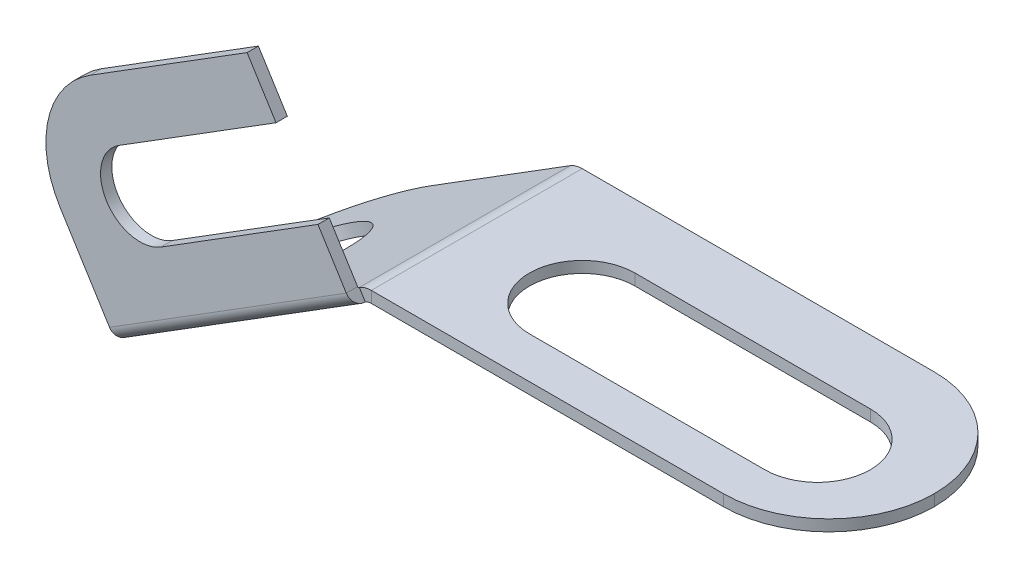
ISO-10303-21;
HEADER;
FILE_DESCRIPTION(('STEP AP214'),'2;1');
FILE_NAME('part.step','',(''),(''),'','','');
FILE_SCHEMA(('AUTOMOTIVE_DESIGN { 1 0 10303 214 1 1 1 1 }'));
ENDSEC;
DATA;
#1=APPLICATION_CONTEXT('core data for automotive mechanical design processes');
#2=APPLICATION_PROTOCOL_DEFINITION('international standard','automotive_design',2000,#1);
#3=PRODUCT_CONTEXT('',#1,'mechanical');
#4=PRODUCT('Part','Part','',(#3));
#5=PRODUCT_RELATED_PRODUCT_CATEGORY('part','',(#4));
#6=PRODUCT_DEFINITION_FORMATION('','',#4);
#7=PRODUCT_DEFINITION_CONTEXT('part definition',#1,'design');
#8=PRODUCT_DEFINITION('design','',#6,#7);
#9=PRODUCT_DEFINITION_SHAPE('','',#8);
#10=(LENGTH_UNIT() NAMED_UNIT(*) SI_UNIT(.MILLI.,.METRE.));
#11=(NAMED_UNIT(*) PLANE_ANGLE_UNIT() SI_UNIT($,.RADIAN.));
#12=(NAMED_UNIT(*) SI_UNIT($,.STERADIAN.) SOLID_ANGLE_UNIT());
#13=UNCERTAINTY_MEASURE_WITH_UNIT(LENGTH_MEASURE(1.E-05),#10,'distance_accuracy_value','');
#14=(GEOMETRIC_REPRESENTATION_CONTEXT(3) GLOBAL_UNCERTAINTY_ASSIGNED_CONTEXT((#13)) GLOBAL_UNIT_ASSIGNED_CONTEXT((#10,
#11,#12)) REPRESENTATION_CONTEXT('',''));
#15=CARTESIAN_POINT('',(0.,0.,0.));
#16=DIRECTION('',(0.,0.,1.));
#17=DIRECTION('',(1.,0.,0.));
#18=AXIS2_PLACEMENT_3D('',#15,#16,#17);
#19=CARTESIAN_POINT('',(-1.80850957594118,0.829813867695201,0.626000000000004));
#20=DIRECTION('',(-0.84804809615643,-0.529919264233199,0.));
#21=DIRECTION('',(0.529919264233199,-0.84804809615643,0.));
#22=AXIS2_PLACEMENT_3D('',#19,#20,#21);
#23=PLANE('',#22);
#24=DIRECTION('',(0.529919264233199,-0.84804809615643,0.));
#25=VECTOR('',#24,1.);
#26=CARTESIAN_POINT('',(-1.80850957594118,0.829813867695201,0.566000000000004));
#27=LINE('',#26,#25);
#28=CARTESIAN_POINT('',(-1.28176982729339,-0.013145939884287,0.566));
#29=VERTEX_POINT('',#28);
#30=CARTESIAN_POINT('',(-1.43226689833561,0.227699719424136,0.566000000000001));
#31=VERTEX_POINT('',#30);
#32=EDGE_CURVE('E323',#29,#31,#27,.F.);
#33=ORIENTED_EDGE('',*,*,#32,.T.);
#34=DIRECTION('',(0.,0.,1.));
#35=VECTOR('',#34,1.);
#36=CARTESIAN_POINT('',(-1.43226689833561,0.227699719424136,0.626000000000001));
#37=LINE('',#36,#35);
#38=CARTESIAN_POINT('',(-1.43226689833561,0.227699719424136,0.626000000000001));
#39=VERTEX_POINT('',#38);
#40=EDGE_CURVE('E298',#31,#39,#37,.T.);
#41=ORIENTED_EDGE('',*,*,#40,.T.);
#42=DIRECTION('',(-0.529919264233199,0.84804809615643,0.));
#43=VECTOR('',#42,1.);
#44=CARTESIAN_POINT('',(-0.92773811445232,-0.579715114319397,0.625999999999998));
#45=LINE('',#44,#43);
#46=CARTESIAN_POINT('',(-1.28176982729338,-0.0131459398842896,0.626));
#47=VERTEX_POINT('',#46);
#48=EDGE_CURVE('E314',#47,#39,#45,.T.);
#49=ORIENTED_EDGE('',*,*,#48,.F.);
#50=DIRECTION('',(0.,0.,-1.));
#51=VECTOR('',#50,1.);
#52=CARTESIAN_POINT('',(-1.28176982729338,-0.0131459398842896,0.566));
#53=LINE('',#52,#51);
#54=EDGE_CURVE('E330',#29,#47,#53,.F.);
#55=ORIENTED_EDGE('',*,*,#54,.F.);
#56=EDGE_LOOP('',(#33,#41,#49,#55));
#57=FACE_BOUND('',#56,.T.);
#58=ADVANCED_FACE('F77',(#57),#23,.F.);
#59=CARTESIAN_POINT('',(-1.215,-0.06,0.56));
#60=DIRECTION('',(0.,0.,1.));
#61=DIRECTION('',(1.,0.,0.));
#62=AXIS2_PLACEMENT_3D('',#59,#60,#61);
#63=PLANE('',#62);
#64=DIRECTION('',(1.,0.,0.));
#65=VECTOR('',#64,1.);
#66=CARTESIAN_POINT('',(-1.215,-0.06,0.56));
#67=LINE('',#66,#65);
#68=CARTESIAN_POINT('',(-1.215,-0.06,0.56));
#69=VERTEX_POINT('',#68);
#70=CARTESIAN_POINT('',(0.655,-0.06,0.56));
#71=VERTEX_POINT('',#70);
#72=EDGE_CURVE('E395',#69,#71,#67,.T.);
#73=ORIENTED_EDGE('',*,*,#72,.T.);
#74=DIRECTION('',(0.,1.,0.));
#75=VECTOR('',#74,1.);
#76=CARTESIAN_POINT('',(0.655,-0.06,0.56));
#77=LINE('',#76,#75);
#78=CARTESIAN_POINT('',(0.655,0.,0.56));
#79=VERTEX_POINT('',#78);
#80=EDGE_CURVE('E431',#71,#79,#77,.T.);
#81=ORIENTED_EDGE('',*,*,#80,.T.);
#82=DIRECTION('',(1.,0.,0.));
#83=VECTOR('',#82,1.);
#84=CARTESIAN_POINT('',(-1.215,0.,0.56));
#85=LINE('',#84,#83);
#86=CARTESIAN_POINT('',(-1.215,0.,0.56));
#87=VERTEX_POINT('',#86);
#88=EDGE_CURVE('E393',#87,#79,#85,.T.);
#89=ORIENTED_EDGE('',*,*,#88,.F.);
#90=DIRECTION('',(0.,1.,0.));
#91=VECTOR('',#90,1.);
#92=CARTESIAN_POINT('',(-1.215,-0.06,0.56));
#93=LINE('',#92,#91);
#94=EDGE_CURVE('E405',#69,#87,#93,.T.);
#95=ORIENTED_EDGE('',*,*,#94,.F.);
#96=EDGE_LOOP('',(#73,#81,#89,#95));
#97=FACE_BOUND('',#96,.T.);
#98=ADVANCED_FACE('F450',(#97),#63,.T.);
#99=CARTESIAN_POINT('',(-1.215,-0.06,-0.56));
#100=DIRECTION('',(0.,0.,-1.));
#101=DIRECTION('',(-1.,0.,0.));
#102=AXIS2_PLACEMENT_3D('',#99,#100,#101);
#103=PLANE('',#102);
#104=DIRECTION('',(-1.,0.,0.));
#105=VECTOR('',#104,1.);
#106=CARTESIAN_POINT('',(-1.215,0.,-0.56));
#107=LINE('',#106,#105);
#108=CARTESIAN_POINT('',(0.655,0.,-0.56));
#109=VERTEX_POINT('',#108);
#110=CARTESIAN_POINT('',(-1.215,0.,-0.56));
#111=VERTEX_POINT('',#110);
#112=EDGE_CURVE('E381',#109,#111,#107,.T.);
#113=ORIENTED_EDGE('',*,*,#112,.F.);
#114=DIRECTION('',(0.,1.,0.));
#115=VECTOR('',#114,1.);
#116=CARTESIAN_POINT('',(0.655,-0.06,-0.56));
#117=LINE('',#116,#115);
#118=CARTESIAN_POINT('',(0.655,-0.06,-0.56));
#119=VERTEX_POINT('',#118);
#120=EDGE_CURVE('E13',#109,#119,#117,.F.);
#121=ORIENTED_EDGE('',*,*,#120,.T.);
#122=DIRECTION('',(-1.,0.,0.));
#123=VECTOR('',#122,1.);
#124=CARTESIAN_POINT('',(-1.215,-0.06,-0.56));
#125=LINE('',#124,#123);
#126=CARTESIAN_POINT('',(-1.215,-0.0600000000000008,-0.56));
#127=VERTEX_POINT('',#126);
#128=EDGE_CURVE('E390',#119,#127,#125,.T.);
#129=ORIENTED_EDGE('',*,*,#128,.T.);
#130=DIRECTION('',(0.,1.,0.));
#131=VECTOR('',#130,1.);
#132=CARTESIAN_POINT('',(-1.215,-0.06,-0.56));
#133=LINE('',#132,#131);
#134=EDGE_CURVE('E398',#127,#111,#133,.T.);
#135=ORIENTED_EDGE('',*,*,#134,.T.);
#136=EDGE_LOOP('',(#113,#121,#129,#135));
#137=FACE_BOUND('',#136,.T.);
#138=ADVANCED_FACE('F462',(#137),#103,.T.);
#139=CARTESIAN_POINT('',(0.,-0.06,0.));
#140=DIRECTION('',(0.,1.,0.));
#141=DIRECTION('',(0.,0.,1.));
#142=AXIS2_PLACEMENT_3D('',#139,#140,#141);
#143=PLANE('',#142);
#144=DIRECTION('',(-1.,0.,0.));
#145=VECTOR('',#144,1.);
#146=CARTESIAN_POINT('',(0.,-0.06,-0.22));
#147=LINE('',#146,#145);
#148=CARTESIAN_POINT('',(0.655,-0.0599999999999993,-0.22));
#149=VERTEX_POINT('',#148);
#150=CARTESIAN_POINT('',(-0.595,-0.0599999999999993,-0.22));
#151=VERTEX_POINT('',#150);
#152=EDGE_CURVE('E270',#149,#151,#147,.T.);
#153=ORIENTED_EDGE('',*,*,#152,.T.);
#154=CARTESIAN_POINT('',(-0.595,-0.0599999999999993,0.0600000000000002));
#155=DIRECTION('',(0.,1.,0.));
#156=DIRECTION('',(0.,0.,1.));
#157=AXIS2_PLACEMENT_3D('',#154,#155,#156);
#158=CIRCLE('',#157,0.28);
#159=CARTESIAN_POINT('',(-0.595,-0.0599999999999993,0.34));
#160=VERTEX_POINT('',#159);
#161=EDGE_CURVE('E273',#151,#160,#158,.T.);
#162=ORIENTED_EDGE('',*,*,#161,.T.);
#163=DIRECTION('',(1.,0.,0.));
#164=VECTOR('',#163,1.);
#165=CARTESIAN_POINT('',(0.,-0.06,0.34));
#166=LINE('',#165,#164);
#167=CARTESIAN_POINT('',(0.655,-0.06,0.34));
#168=VERTEX_POINT('',#167);
#169=EDGE_CURVE('E265',#160,#168,#166,.T.);
#170=ORIENTED_EDGE('',*,*,#169,.T.);
#171=CARTESIAN_POINT('',(0.655,-0.0599999999999993,0.0600000000000002));
#172=DIRECTION('',(0.,1.,0.));
#173=DIRECTION('',(0.,0.,1.));
#174=AXIS2_PLACEMENT_3D('',#171,#172,#173);
#175=CIRCLE('',#174,0.28);
#176=EDGE_CURVE('E240',#168,#149,#175,.T.);
#177=ORIENTED_EDGE('',*,*,#176,.T.);
#178=EDGE_LOOP('',(#153,#162,#170,#177));
#179=FACE_BOUND('',#178,.T.);
#180=CARTESIAN_POINT('',(0.655,-0.06,0.));
#181=DIRECTION('',(0.,1.,0.));
#182=DIRECTION('',(0.,0.,1.));
#183=AXIS2_PLACEMENT_3D('',#180,#181,#182);
#184=CIRCLE('',#183,0.56);
#185=CARTESIAN_POINT('',(1.215,-0.06,0.));
#186=VERTEX_POINT('',#185);
#187=EDGE_CURVE('E98',#119,#186,#184,.F.);
#188=ORIENTED_EDGE('',*,*,#187,.T.);
#189=CARTESIAN_POINT('',(0.655,-0.06,0.));
#190=DIRECTION('',(0.,1.,0.));
#191=DIRECTION('',(0.,0.,1.));
#192=AXIS2_PLACEMENT_3D('',#189,#190,#191);
#193=CIRCLE('',#192,0.56);
#194=EDGE_CURVE('E86',#186,#71,#193,.F.);
#195=ORIENTED_EDGE('',*,*,#194,.T.);
#196=ORIENTED_EDGE('',*,*,#72,.F.);
#197=DIRECTION('',(0.,0.,1.));
#198=VECTOR('',#197,1.);
#199=CARTESIAN_POINT('',(-1.215,-0.06,-0.56));
#200=LINE('',#199,#198);
#201=EDGE_CURVE('E392',#127,#69,#200,.T.);
#202=ORIENTED_EDGE('',*,*,#201,.F.);
#203=ORIENTED_EDGE('',*,*,#128,.F.);
#204=EDGE_LOOP('',(#188,#195,#196,#202,#203));
#205=FACE_BOUND('',#204,.T.);
#206=ADVANCED_FACE('F443',(#179,#205),#143,.F.);
#207=CARTESIAN_POINT('',(0.,0.,0.));
#208=DIRECTION('',(0.,1.,0.));
#209=DIRECTION('',(0.,0.,1.));
#210=AXIS2_PLACEMENT_3D('',#207,#208,#209);
#211=PLANE('',#210);
#212=CARTESIAN_POINT('',(-0.595,0.,0.0600000000000002));
#213=DIRECTION('',(0.,1.,0.));
#214=DIRECTION('',(0.,0.,1.));
#215=AXIS2_PLACEMENT_3D('',#212,#213,#214);
#216=CIRCLE('',#215,0.28);
#217=CARTESIAN_POINT('',(-0.595,0.,-0.22));
#218=VERTEX_POINT('',#217);
#219=CARTESIAN_POINT('',(-0.595,0.,0.34));
#220=VERTEX_POINT('',#219);
#221=EDGE_CURVE('E253',#218,#220,#216,.T.);
#222=ORIENTED_EDGE('',*,*,#221,.F.);
#223=DIRECTION('',(-1.,0.,0.));
#224=VECTOR('',#223,1.);
#225=CARTESIAN_POINT('',(-0.595,0.,-0.22));
#226=LINE('',#225,#224);
#227=CARTESIAN_POINT('',(0.655,0.,-0.22));
#228=VERTEX_POINT('',#227);
#229=EDGE_CURVE('E258',#228,#218,#226,.T.);
#230=ORIENTED_EDGE('',*,*,#229,.F.);
#231=CARTESIAN_POINT('',(0.655,0.,0.0600000000000002));
#232=DIRECTION('',(0.,1.,0.));
#233=DIRECTION('',(0.,0.,1.));
#234=AXIS2_PLACEMENT_3D('',#231,#232,#233);
#235=CIRCLE('',#234,0.28);
#236=CARTESIAN_POINT('',(0.655,0.,0.34));
#237=VERTEX_POINT('',#236);
#238=EDGE_CURVE('E237',#237,#228,#235,.T.);
#239=ORIENTED_EDGE('',*,*,#238,.F.);
#240=DIRECTION('',(1.,0.,0.));
#241=VECTOR('',#240,1.);
#242=CARTESIAN_POINT('',(-0.595,0.,0.34));
#243=LINE('',#242,#241);
#244=EDGE_CURVE('E248',#220,#237,#243,.T.);
#245=ORIENTED_EDGE('',*,*,#244,.F.);
#246=EDGE_LOOP('',(#222,#230,#239,#245));
#247=FACE_BOUND('',#246,.T.);
#248=ORIENTED_EDGE('',*,*,#88,.T.);
#249=CARTESIAN_POINT('',(0.655,0.,0.));
#250=DIRECTION('',(0.,1.,0.));
#251=DIRECTION('',(0.,0.,1.));
#252=AXIS2_PLACEMENT_3D('',#249,#250,#251);
#253=CIRCLE('',#252,0.56);
#254=CARTESIAN_POINT('',(1.215,0.,0.));
#255=VERTEX_POINT('',#254);
#256=EDGE_CURVE('E438',#79,#255,#253,.T.);
#257=ORIENTED_EDGE('',*,*,#256,.T.);
#258=CARTESIAN_POINT('',(0.655,0.,0.));
#259=DIRECTION('',(0.,1.,0.));
#260=DIRECTION('',(0.,0.,1.));
#261=AXIS2_PLACEMENT_3D('',#258,#259,#260);
#262=CIRCLE('',#261,0.56);
#263=EDGE_CURVE('E436',#255,#109,#262,.T.);
#264=ORIENTED_EDGE('',*,*,#263,.T.);
#265=ORIENTED_EDGE('',*,*,#112,.T.);
#266=DIRECTION('',(0.,0.,1.));
#267=VECTOR('',#266,1.);
#268=CARTESIAN_POINT('',(-1.215,0.,-0.56));
#269=LINE('',#268,#267);
#270=EDGE_CURVE('E400',#111,#87,#269,.T.);
#271=ORIENTED_EDGE('',*,*,#270,.T.);
#272=EDGE_LOOP('',(#248,#257,#264,#265,#271));
#273=FACE_BOUND('',#272,.T.);
#274=ADVANCED_FACE('F255',(#247,#273),#211,.T.);
#275=CARTESIAN_POINT('',(-1.215,-0.120000000000001,0.56));
#276=DIRECTION('',(0.,0.,1.));
#277=DIRECTION('',(0.,-1.,0.));
#278=AXIS2_PLACEMENT_3D('',#275,#276,#277);
#279=PLANE('',#278);
#280=DIRECTION('',(-0.5299192642332,0.848048096156429,0.));
#281=VECTOR('',#280,1.);
#282=CARTESIAN_POINT('',(-1.27859031170798,-0.0182342284612291,0.56));
#283=LINE('',#282,#281);
#284=CARTESIAN_POINT('',(-1.24679515585399,-0.0691171142306113,0.56));
#285=VERTEX_POINT('',#284);
#286=CARTESIAN_POINT('',(-1.27859031170799,-0.0182342284612257,0.56));
#287=VERTEX_POINT('',#286);
#288=EDGE_CURVE('E340',#285,#287,#283,.T.);
#289=ORIENTED_EDGE('',*,*,#288,.F.);
#290=CARTESIAN_POINT('',(-1.215,-0.120000000000001,0.56));
#291=DIRECTION('',(0.,0.,-1.));
#292=DIRECTION('',(0.,1.,0.));
#293=AXIS2_PLACEMENT_3D('',#290,#291,#292);
#294=CIRCLE('',#293,0.0600000000000006);
#295=EDGE_CURVE('E385',#69,#285,#294,.F.);
#296=ORIENTED_EDGE('',*,*,#295,.F.);
#297=ORIENTED_EDGE('',*,*,#94,.T.);
#298=CARTESIAN_POINT('',(-1.215,-0.120000000000001,0.56));
#299=DIRECTION('',(0.,0.,-1.));
#300=DIRECTION('',(0.,1.,0.));
#301=AXIS2_PLACEMENT_3D('',#298,#299,#300);
#302=CIRCLE('',#301,0.120000000000001);
#303=EDGE_CURVE('E378',#87,#287,#302,.F.);
#304=ORIENTED_EDGE('',*,*,#303,.T.);
#305=EDGE_LOOP('',(#289,#296,#297,#304));
#306=FACE_BOUND('',#305,.T.);
#307=ADVANCED_FACE('F468',(#306),#279,.T.);
#308=CARTESIAN_POINT('',(-1.215,-0.120000000000001,-0.56));
#309=DIRECTION('',(0.,0.,1.));
#310=DIRECTION('',(0.,-1.,0.));
#311=AXIS2_PLACEMENT_3D('',#308,#309,#310);
#312=PLANE('',#311);
#313=CARTESIAN_POINT('',(-1.215,-0.120000000000001,-0.56));
#314=DIRECTION('',(0.,0.,-1.));
#315=DIRECTION('',(0.,1.,0.));
#316=AXIS2_PLACEMENT_3D('',#313,#314,#315);
#317=CIRCLE('',#316,0.0600000000000006);
#318=CARTESIAN_POINT('',(-1.24679515585399,-0.0691171142306151,-0.56));
#319=VERTEX_POINT('',#318);
#320=EDGE_CURVE('E352',#319,#127,#317,.T.);
#321=ORIENTED_EDGE('',*,*,#320,.F.);
#322=DIRECTION('',(-0.5299192642332,0.848048096156429,0.));
#323=VECTOR('',#322,1.);
#324=CARTESIAN_POINT('',(-1.24679515585399,-0.0691171142306145,-0.56));
#325=LINE('',#324,#323);
#326=CARTESIAN_POINT('',(-1.27859031170798,-0.0182342284612289,-0.56));
#327=VERTEX_POINT('',#326);
#328=EDGE_CURVE('E371',#319,#327,#325,.T.);
#329=ORIENTED_EDGE('',*,*,#328,.T.);
#330=CARTESIAN_POINT('',(-1.215,-0.120000000000001,-0.56));
#331=DIRECTION('',(0.,0.,-1.));
#332=DIRECTION('',(0.,1.,0.));
#333=AXIS2_PLACEMENT_3D('',#330,#331,#332);
#334=CIRCLE('',#333,0.120000000000001);
#335=EDGE_CURVE('E382',#327,#111,#334,.T.);
#336=ORIENTED_EDGE('',*,*,#335,.T.);
#337=ORIENTED_EDGE('',*,*,#134,.F.);
#338=EDGE_LOOP('',(#321,#329,#336,#337));
#339=FACE_BOUND('',#338,.T.);
#340=ADVANCED_FACE('F558',(#339),#312,.F.);
#341=CARTESIAN_POINT('',(-1.215,-0.120000000000001,-0.56));
#342=DIRECTION('',(0.,0.,-1.));
#343=DIRECTION('',(-0.5299192642332,0.848048096156429,0.));
#344=AXIS2_PLACEMENT_3D('',#341,#342,#343);
#345=CYLINDRICAL_SURFACE('',#344,0.120000000000001);
#346=ORIENTED_EDGE('',*,*,#270,.F.);
#347=ORIENTED_EDGE('',*,*,#335,.F.);
#348=DIRECTION('',(0.,0.,-1.));
#349=VECTOR('',#348,1.);
#350=CARTESIAN_POINT('',(-1.27859031170798,-0.0182342284612288,0.));
#351=LINE('',#350,#349);
#352=EDGE_CURVE('E368',#287,#327,#351,.T.);
#353=ORIENTED_EDGE('',*,*,#352,.F.);
#354=ORIENTED_EDGE('',*,*,#303,.F.);
#355=EDGE_LOOP('',(#346,#347,#353,#354));
#356=FACE_BOUND('',#355,.T.);
#357=ADVANCED_FACE('F565',(#356),#345,.T.);
#358=CARTESIAN_POINT('',(-1.215,-0.120000000000001,-0.56));
#359=DIRECTION('',(0.,0.,-1.));
#360=DIRECTION('',(-0.5299192642332,0.848048096156429,0.));
#361=AXIS2_PLACEMENT_3D('',#358,#359,#360);
#362=CYLINDRICAL_SURFACE('',#361,0.0600000000000006);
#363=ORIENTED_EDGE('',*,*,#201,.T.);
#364=ORIENTED_EDGE('',*,*,#295,.T.);
#365=DIRECTION('',(0.,0.,1.));
#366=VECTOR('',#365,1.);
#367=CARTESIAN_POINT('',(-1.24679515585399,-0.0691171142306143,0.56));
#368=LINE('',#367,#366);
#369=EDGE_CURVE('E374',#285,#319,#368,.F.);
#370=ORIENTED_EDGE('',*,*,#369,.T.);
#371=ORIENTED_EDGE('',*,*,#320,.T.);
#372=EDGE_LOOP('',(#363,#364,#370,#371));
#373=FACE_BOUND('',#372,.T.);
#374=ADVANCED_FACE('F569',(#373),#362,.F.);
#375=CARTESIAN_POINT('',(-1.26399987899952,-0.00911711423061442,-0.56));
#376=DIRECTION('',(0.,0.,-1.));
#377=DIRECTION('',(-1.,0.,0.));
#378=AXIS2_PLACEMENT_3D('',#375,#376,#377);
#379=PLANE('',#378);
#380=DIRECTION('',(-0.848048096156429,-0.5299192642332,0.));
#381=VECTOR('',#380,1.);
#382=CARTESIAN_POINT('',(-0.331430430082182,0.502866248723068,-0.56));
#383=LINE('',#382,#381);
#384=CARTESIAN_POINT('',(-1.97848704776319,-0.526328952525216,-0.56));
#385=VERTEX_POINT('',#384);
#386=EDGE_CURVE('E360',#385,#319,#383,.F.);
#387=ORIENTED_EDGE('',*,*,#386,.F.);
#388=DIRECTION('',(0.5299192642332,-0.848048096156429,0.));
#389=VECTOR('',#388,1.);
#390=CARTESIAN_POINT('',(-2.01028220361718,-0.475446066755831,-0.56));
#391=LINE('',#390,#389);
#392=CARTESIAN_POINT('',(-2.01028220361718,-0.47544606675583,-0.56));
#393=VERTEX_POINT('',#392);
#394=EDGE_CURVE('E415',#385,#393,#391,.F.);
#395=ORIENTED_EDGE('',*,*,#394,.T.);
#396=DIRECTION('',(0.848048096156429,0.5299192642332,0.));
#397=VECTOR('',#396,1.);
#398=CARTESIAN_POINT('',(-1.26399987899952,-0.00911711423061437,-0.56));
#399=LINE('',#398,#397);
#400=EDGE_CURVE('E353',#393,#327,#399,.T.);
#401=ORIENTED_EDGE('',*,*,#400,.T.);
#402=ORIENTED_EDGE('',*,*,#328,.F.);
#403=EDGE_LOOP('',(#387,#395,#401,#402));
#404=FACE_BOUND('',#403,.T.);
#405=ADVANCED_FACE('F553',(#404),#379,.T.);
#406=CARTESIAN_POINT('',(-0.363225585936174,0.553749134492454,0.));
#407=DIRECTION('',(-0.5299192642332,0.848048096156429,0.));
#408=DIRECTION('',(-0.848048096156429,-0.5299192642332,0.));
#409=AXIS2_PLACEMENT_3D('',#406,#407,#408);
#410=PLANE('',#409);
#411=CARTESIAN_POINT('',(-2.11204797515595,-0.539036378463815,0.0600000000000002));
#412=DIRECTION('',(-0.5299192642332,0.848048096156429,0.));
#413=DIRECTION('',(-0.848048096156429,-0.5299192642332,0.));
#414=AXIS2_PLACEMENT_3D('',#411,#412,#413);
#415=CIRCLE('',#414,0.31);
#416=CARTESIAN_POINT('',(-2.37494288496444,-0.703311350376107,0.0600000000000002));
#417=VERTEX_POINT('',#416);
#418=EDGE_CURVE('E276',#417,#417,#415,.T.);
#419=ORIENTED_EDGE('',*,*,#418,.F.);
#420=EDGE_LOOP('',(#419));
#421=FACE_BOUND('',#420,.T.);
#422=ORIENTED_EDGE('',*,*,#400,.F.);
#423=CARTESIAN_POINT('',(-2.01028220361718,-0.47544606675583,0.0600000000000002));
#424=DIRECTION('',(-0.5299192642332,0.848048096156429,0.));
#425=DIRECTION('',(-0.848048096156429,-0.5299192642332,0.));
#426=AXIS2_PLACEMENT_3D('',#423,#424,#425);
#427=CIRCLE('',#426,0.62);
#428=CARTESIAN_POINT('',(-2.53607202323416,-0.803996010580414,0.0600000000000004));
#429=VERTEX_POINT('',#428);
#430=EDGE_CURVE('E417',#393,#429,#427,.T.);
#431=ORIENTED_EDGE('',*,*,#430,.T.);
#432=DIRECTION('',(0.,0.,-1.));
#433=VECTOR('',#432,1.);
#434=CARTESIAN_POINT('',(-2.53607202323416,-0.803996010580414,-0.56));
#435=LINE('',#434,#433);
#436=CARTESIAN_POINT('',(-2.53607202323416,-0.803996010580416,0.56));
#437=VERTEX_POINT('',#436);
#438=EDGE_CURVE('E355',#437,#429,#435,.T.);
#439=ORIENTED_EDGE('',*,*,#438,.F.);
#440=DIRECTION('',(-0.848048096156429,-0.5299192642332,0.));
#441=VECTOR('',#440,1.);
#442=CARTESIAN_POINT('',(-2.53607202323416,-0.803996010580414,0.56));
#443=LINE('',#442,#441);
#444=EDGE_CURVE('E358',#287,#437,#443,.T.);
#445=ORIENTED_EDGE('',*,*,#444,.F.);
#446=ORIENTED_EDGE('',*,*,#352,.T.);
#447=EDGE_LOOP('',(#422,#431,#439,#445,#446));
#448=FACE_BOUND('',#447,.T.);
#449=ADVANCED_FACE('F562',(#421,#448),#410,.T.);
#450=CARTESIAN_POINT('',(-0.331430430082182,0.502866248723068,0.));
#451=DIRECTION('',(-0.5299192642332,0.848048096156429,0.));
#452=DIRECTION('',(-0.848048096156429,-0.5299192642332,0.));
#453=AXIS2_PLACEMENT_3D('',#450,#451,#452);
#454=PLANE('',#453);
#455=CARTESIAN_POINT('',(-2.08025281930196,-0.589919264233203,0.0600000000000002));
#456=DIRECTION('',(-0.5299192642332,0.848048096156429,0.));
#457=DIRECTION('',(-0.848048096156429,-0.5299192642332,0.));
#458=AXIS2_PLACEMENT_3D('',#455,#456,#457);
#459=CIRCLE('',#458,0.31);
#460=CARTESIAN_POINT('',(-2.34314772911045,-0.754194236145494,0.0600000000000002));
#461=VERTEX_POINT('',#460);
#462=EDGE_CURVE('E279',#461,#461,#459,.T.);
#463=ORIENTED_EDGE('',*,*,#462,.T.);
#464=EDGE_LOOP('',(#463));
#465=FACE_BOUND('',#464,.T.);
#466=DIRECTION('',(0.,0.,1.));
#467=VECTOR('',#466,1.);
#468=CARTESIAN_POINT('',(-2.50427686738017,-0.8548788963498,0.));
#469=LINE('',#468,#467);
#470=CARTESIAN_POINT('',(-2.50427686738017,-0.8548788963498,0.56));
#471=VERTEX_POINT('',#470);
#472=CARTESIAN_POINT('',(-2.50427686738017,-0.8548788963498,0.0600000000000004));
#473=VERTEX_POINT('',#472);
#474=EDGE_CURVE('E362',#471,#473,#469,.F.);
#475=ORIENTED_EDGE('',*,*,#474,.T.);
#476=CARTESIAN_POINT('',(-1.97848704776319,-0.526328952525216,0.0600000000000002));
#477=DIRECTION('',(-0.5299192642332,0.848048096156429,0.));
#478=DIRECTION('',(-0.848048096156429,-0.5299192642332,0.));
#479=AXIS2_PLACEMENT_3D('',#476,#477,#478);
#480=CIRCLE('',#479,0.62);
#481=EDGE_CURVE('E413',#473,#385,#480,.F.);
#482=ORIENTED_EDGE('',*,*,#481,.T.);
#483=ORIENTED_EDGE('',*,*,#386,.T.);
#484=ORIENTED_EDGE('',*,*,#369,.F.);
#485=DIRECTION('',(0.848048096156429,0.5299192642332,0.));
#486=VECTOR('',#485,1.);
#487=CARTESIAN_POINT('',(-0.331430430082182,0.502866248723068,0.56));
#488=LINE('',#487,#486);
#489=EDGE_CURVE('E365',#285,#471,#488,.F.);
#490=ORIENTED_EDGE('',*,*,#489,.T.);
#491=EDGE_LOOP('',(#475,#482,#483,#484,#490));
#492=FACE_BOUND('',#491,.T.);
#493=ADVANCED_FACE('F541',(#465,#492),#454,.F.);
#494=CARTESIAN_POINT('',(-2.53607202323416,-0.803996010580414,-0.56));
#495=DIRECTION('',(-0.848048096156429,-0.5299192642332,0.));
#496=DIRECTION('',(0.5299192642332,-0.848048096156429,0.));
#497=AXIS2_PLACEMENT_3D('',#494,#495,#496);
#498=PLANE('',#497);
#499=ORIENTED_EDGE('',*,*,#438,.T.);
#500=DIRECTION('',(0.5299192642332,-0.848048096156429,0.));
#501=VECTOR('',#500,1.);
#502=CARTESIAN_POINT('',(-2.53607202323416,-0.803996010580414,0.0600000000000004));
#503=LINE('',#502,#501);
#504=EDGE_CURVE('E408',#429,#473,#503,.T.);
#505=ORIENTED_EDGE('',*,*,#504,.T.);
#506=ORIENTED_EDGE('',*,*,#474,.F.);
#507=DIRECTION('',(0.5299192642332,-0.848048096156429,0.));
#508=VECTOR('',#507,1.);
#509=CARTESIAN_POINT('',(-2.53607202323416,-0.803996010580414,0.56));
#510=LINE('',#509,#508);
#511=EDGE_CURVE('E349',#437,#471,#510,.T.);
#512=ORIENTED_EDGE('',*,*,#511,.F.);
#513=EDGE_LOOP('',(#499,#505,#506,#512));
#514=FACE_BOUND('',#513,.T.);
#515=ADVANCED_FACE('F543',(#514),#498,.T.);
#516=CARTESIAN_POINT('',(-2.01028220361718,-0.47544606675583,0.0600000000000002));
#517=DIRECTION('',(0.5299192642332,-0.848048096156429,0.));
#518=DIRECTION('',(0.848048096156429,0.5299192642332,0.));
#519=AXIS2_PLACEMENT_3D('',#516,#517,#518);
#520=CYLINDRICAL_SURFACE('',#519,0.62);
#521=ORIENTED_EDGE('',*,*,#430,.F.);
#522=ORIENTED_EDGE('',*,*,#394,.F.);
#523=ORIENTED_EDGE('',*,*,#481,.F.);
#524=ORIENTED_EDGE('',*,*,#504,.F.);
#525=EDGE_LOOP('',(#521,#522,#523,#524));
#526=FACE_BOUND('',#525,.T.);
#527=ADVANCED_FACE('F548',(#526),#520,.T.);
#528=CARTESIAN_POINT('',(-2.53925153881956,-0.798907722003478,0.56));
#529=DIRECTION('',(-0.848048096156427,-0.529919264233203,0.));
#530=DIRECTION('',(0.529919264233203,-0.848048096156427,0.));
#531=AXIS2_PLACEMENT_3D('',#528,#529,#530);
#532=PLANE('',#531);
#533=DIRECTION('',(0.,0.,-1.));
#534=VECTOR('',#533,1.);
#535=CARTESIAN_POINT('',(-2.53925153881956,-0.798907722003475,0.626));
#536=LINE('',#535,#534);
#537=CARTESIAN_POINT('',(-2.53925153881956,-0.798907722003478,0.566));
#538=VERTEX_POINT('',#537);
#539=CARTESIAN_POINT('',(-2.53925153881956,-0.79890772200348,0.626));
#540=VERTEX_POINT('',#539);
#541=EDGE_CURVE('E304',#538,#540,#536,.F.);
#542=ORIENTED_EDGE('',*,*,#541,.F.);
#543=CARTESIAN_POINT('',(-2.53925153881956,-0.798907722003478,0.56));
#544=DIRECTION('',(0.848048096156427,0.529919264233203,0.));
#545=DIRECTION('',(-0.529919264233203,0.848048096156427,0.));
#546=AXIS2_PLACEMENT_3D('',#543,#544,#545);
#547=CIRCLE('',#546,0.00600000000000015);
#548=EDGE_CURVE('E344',#437,#538,#547,.F.);
#549=ORIENTED_EDGE('',*,*,#548,.F.);
#550=ORIENTED_EDGE('',*,*,#511,.T.);
#551=CARTESIAN_POINT('',(-2.53925153881956,-0.798907722003478,0.56));
#552=DIRECTION('',(0.848048096156427,0.529919264233203,0.));
#553=DIRECTION('',(-0.529919264233203,0.848048096156427,0.));
#554=AXIS2_PLACEMENT_3D('',#551,#552,#553);
#555=CIRCLE('',#554,0.0660000000000001);
#556=EDGE_CURVE('E337',#471,#540,#555,.F.);
#557=ORIENTED_EDGE('',*,*,#556,.T.);
#558=EDGE_LOOP('',(#542,#549,#550,#557));
#559=FACE_BOUND('',#558,.T.);
#560=ADVANCED_FACE('F527',(#559),#532,.T.);
#561=CARTESIAN_POINT('',(-1.28176982729339,-0.013145939884287,0.56));
#562=DIRECTION('',(-0.848048096156427,-0.529919264233203,0.));
#563=DIRECTION('',(0.529919264233203,-0.848048096156427,0.));
#564=AXIS2_PLACEMENT_3D('',#561,#562,#563);
#565=PLANE('',#564);
#566=CARTESIAN_POINT('',(-1.28176982729339,-0.013145939884287,0.56));
#567=DIRECTION('',(0.848048096156427,0.529919264233203,0.));
#568=DIRECTION('',(-0.529919264233203,0.848048096156427,0.));
#569=AXIS2_PLACEMENT_3D('',#566,#567,#568);
#570=CIRCLE('',#569,0.00600000000000015);
#571=EDGE_CURVE('E308',#29,#287,#570,.T.);
#572=ORIENTED_EDGE('',*,*,#571,.F.);
#573=ORIENTED_EDGE('',*,*,#54,.T.);
#574=CARTESIAN_POINT('',(-1.28176982729339,-0.013145939884287,0.56));
#575=DIRECTION('',(0.848048096156427,0.529919264233203,0.));
#576=DIRECTION('',(-0.529919264233203,0.848048096156427,0.));
#577=AXIS2_PLACEMENT_3D('',#574,#575,#576);
#578=CIRCLE('',#577,0.0660000000000001);
#579=EDGE_CURVE('E341',#47,#285,#578,.T.);
#580=ORIENTED_EDGE('',*,*,#579,.T.);
#581=ORIENTED_EDGE('',*,*,#288,.T.);
#582=EDGE_LOOP('',(#572,#573,#580,#581));
#583=FACE_BOUND('',#582,.T.);
#584=ADVANCED_FACE('F535',(#583),#565,.F.);
#585=CARTESIAN_POINT('',(-1.28176982729339,-0.013145939884287,0.56));
#586=DIRECTION('',(0.848048096156427,0.529919264233203,0.));
#587=DIRECTION('',(0.,0.,1.));
#588=AXIS2_PLACEMENT_3D('',#585,#586,#587);
#589=CYLINDRICAL_SURFACE('',#588,0.0660000000000001);
#590=ORIENTED_EDGE('',*,*,#489,.F.);
#591=ORIENTED_EDGE('',*,*,#579,.F.);
#592=DIRECTION('',(0.848048096156429,0.5299192642332,0.));
#593=VECTOR('',#592,1.);
#594=CARTESIAN_POINT('',(-2.53925153881956,-0.798907722003475,0.626));
#595=LINE('',#594,#593);
#596=EDGE_CURVE('E327',#47,#540,#595,.F.);
#597=ORIENTED_EDGE('',*,*,#596,.T.);
#598=ORIENTED_EDGE('',*,*,#556,.F.);
#599=EDGE_LOOP('',(#590,#591,#597,#598));
#600=FACE_BOUND('',#599,.T.);
#601=ADVANCED_FACE('F493',(#600),#589,.T.);
#602=CARTESIAN_POINT('',(-1.28176982729339,-0.013145939884287,0.56));
#603=DIRECTION('',(0.848048096156427,0.529919264233203,0.));
#604=DIRECTION('',(0.,0.,1.));
#605=AXIS2_PLACEMENT_3D('',#602,#603,#604);
#606=CYLINDRICAL_SURFACE('',#605,0.00600000000000015);
#607=ORIENTED_EDGE('',*,*,#444,.T.);
#608=ORIENTED_EDGE('',*,*,#548,.T.);
#609=DIRECTION('',(0.848048096156429,0.5299192642332,0.));
#610=VECTOR('',#609,1.);
#611=CARTESIAN_POINT('',(-2.53925153881956,-0.798907722003475,0.566));
#612=LINE('',#611,#610);
#613=EDGE_CURVE('E333',#538,#29,#612,.T.);
#614=ORIENTED_EDGE('',*,*,#613,.T.);
#615=ORIENTED_EDGE('',*,*,#571,.T.);
#616=EDGE_LOOP('',(#607,#608,#614,#615));
#617=FACE_BOUND('',#616,.T.);
#618=ADVANCED_FACE('F484',(#617),#606,.F.);
#619=CARTESIAN_POINT('',(-1.65483298931356,0.583879919809836,0.626000000000002));
#620=VERTEX_POINT('',#619);
#621=CARTESIAN_POINT('',(-1.80850957594118,0.829813867695201,0.626000000000004));
#622=VERTEX_POINT('',#621);
#623=EDGE_CURVE('E317',#620,#622,#45,.T.);
#624=ORIENTED_EDGE('',*,*,#623,.F.);
#625=DIRECTION('',(0.,0.,-1.));
#626=VECTOR('',#625,1.);
#627=CARTESIAN_POINT('',(-1.65483298931356,0.583879919809836,0.626000000000002));
#628=LINE('',#627,#626);
#629=CARTESIAN_POINT('',(-1.65483298931356,0.583879919809836,0.566000000000003));
#630=VERTEX_POINT('',#629);
#631=EDGE_CURVE('E292',#620,#630,#628,.T.);
#632=ORIENTED_EDGE('',*,*,#631,.T.);
#633=CARTESIAN_POINT('',(-1.80850957594118,0.829813867695201,0.566000000000004));
#634=VERTEX_POINT('',#633);
#635=EDGE_CURVE('E326',#630,#634,#27,.F.);
#636=ORIENTED_EDGE('',*,*,#635,.T.);
#637=DIRECTION('',(0.,0.,-1.));
#638=VECTOR('',#637,1.);
#639=CARTESIAN_POINT('',(-1.80850957594118,0.829813867695201,0.626000000000004));
#640=LINE('',#639,#638);
#641=EDGE_CURVE('E305',#622,#634,#640,.T.);
#642=ORIENTED_EDGE('',*,*,#641,.F.);
#643=EDGE_LOOP('',(#624,#632,#636,#642));
#644=FACE_BOUND('',#643,.T.);
#645=ADVANCED_FACE('F475',(#644),#23,.F.);
#646=CARTESIAN_POINT('',(-2.53607202323416,-0.803996010580413,0.626));
#647=DIRECTION('',(0.84804809615643,0.529919264233199,0.));
#648=DIRECTION('',(-0.529919264233199,0.84804809615643,0.));
#649=AXIS2_PLACEMENT_3D('',#646,#647,#648);
#650=PLANE('',#649);
#651=DIRECTION('',(0.529919264233199,-0.84804809615643,0.));
#652=VECTOR('',#651,1.);
#653=CARTESIAN_POINT('',(-2.1852198259785,-1.36547689643858,0.625999999999998));
#654=LINE('',#653,#652);
#655=CARTESIAN_POINT('',(-2.80103165535076,-0.379971962502198,0.626000000000002));
#656=VERTEX_POINT('',#655);
#657=EDGE_CURVE('E309',#656,#540,#654,.T.);
#658=ORIENTED_EDGE('',*,*,#657,.F.);
#659=DIRECTION('',(0.,0.,-1.));
#660=VECTOR('',#659,1.);
#661=CARTESIAN_POINT('',(-2.80103165535076,-0.379971962502199,0.626000000000002));
#662=LINE('',#661,#660);
#663=CARTESIAN_POINT('',(-2.80103165535076,-0.379971962502198,0.566000000000002));
#664=VERTEX_POINT('',#663);
#665=EDGE_CURVE('E422',#656,#664,#662,.T.);
#666=ORIENTED_EDGE('',*,*,#665,.T.);
#667=DIRECTION('',(-0.529919264233199,0.84804809615643,0.));
#668=VECTOR('',#667,1.);
#669=CARTESIAN_POINT('',(-2.53607202323416,-0.803996010580413,0.566));
#670=LINE('',#669,#668);
#671=EDGE_CURVE('E318',#664,#538,#670,.F.);
#672=ORIENTED_EDGE('',*,*,#671,.T.);
#673=ORIENTED_EDGE('',*,*,#541,.T.);
#674=EDGE_LOOP('',(#658,#666,#672,#673));
#675=FACE_BOUND('',#674,.T.);
#676=ADVANCED_FACE('F483',(#675),#650,.F.);
#677=CARTESIAN_POINT('',(0.,0.,0.625999999999997));
#678=DIRECTION('',(0.,0.,-1.));
#679=DIRECTION('',(0.,1.,0.));
#680=AXIS2_PLACEMENT_3D('',#677,#678,#679);
#681=PLANE('',#680);
#682=DIRECTION('',(-0.848048096156429,-0.5299192642332,0.));
#683=VECTOR('',#682,1.);
#684=CARTESIAN_POINT('',(-0.880771461488863,1.4095289820146,0.626000000000003));
#685=LINE('',#684,#683);
#686=CARTESIAN_POINT('',(-2.64196723938915,0.309011717692616,0.626000000000004));
#687=VERTEX_POINT('',#686);
#688=EDGE_CURVE('E311',#622,#687,#685,.T.);
#689=ORIENTED_EDGE('',*,*,#688,.T.);
#690=CARTESIAN_POINT('',(-2.37700760727255,-0.115012330385599,0.626000000000002));
#691=DIRECTION('',(0.,0.,-1.));
#692=DIRECTION('',(0.,1.,0.));
#693=AXIS2_PLACEMENT_3D('',#690,#691,#692);
#694=CIRCLE('',#693,0.5);
#695=EDGE_CURVE('E429',#687,#656,#694,.F.);
#696=ORIENTED_EDGE('',*,*,#695,.T.);
#697=ORIENTED_EDGE('',*,*,#657,.T.);
#698=ORIENTED_EDGE('',*,*,#596,.F.);
#699=ORIENTED_EDGE('',*,*,#48,.T.);
#700=DIRECTION('',(-0.848048096156429,-0.5299192642332,0.));
#701=VECTOR('',#700,1.);
#702=CARTESIAN_POINT('',(-0.504528783883291,0.807414833743531,0.626000000000001));
#703=LINE('',#702,#701);
#704=CARTESIAN_POINT('',(-2.26573219428514,-0.293107199894751,0.626000000000002));
#705=VERTEX_POINT('',#704);
#706=EDGE_CURVE('E295',#39,#705,#703,.T.);
#707=ORIENTED_EDGE('',*,*,#706,.T.);
#708=CARTESIAN_POINT('',(-2.37701523977411,-0.115017099701901,0.626000000000003));
#709=DIRECTION('',(0.,0.,-1.));
#710=DIRECTION('',(0.,1.,0.));
#711=AXIS2_PLACEMENT_3D('',#708,#709,#710);
#712=CIRCLE('',#711,0.21);
#713=CARTESIAN_POINT('',(-2.48829828526308,0.0630730004909488,0.626000000000003));
#714=VERTEX_POINT('',#713);
#715=EDGE_CURVE('E301',#705,#714,#712,.T.);
#716=ORIENTED_EDGE('',*,*,#715,.T.);
#717=DIRECTION('',(0.848048096156429,0.5299192642332,0.));
#718=VECTOR('',#717,1.);
#719=CARTESIAN_POINT('',(-0.727094874861235,1.16359503412923,0.626000000000002));
#720=LINE('',#719,#718);
#721=EDGE_CURVE('E287',#714,#620,#720,.T.);
#722=ORIENTED_EDGE('',*,*,#721,.T.);
#723=ORIENTED_EDGE('',*,*,#623,.T.);
#724=EDGE_LOOP('',(#689,#696,#697,#698,#699,#707,#716,#722,#723));
#725=FACE_BOUND('',#724,.T.);
#726=ADVANCED_FACE('F490',(#725),#681,.F.);
#727=CARTESIAN_POINT('',(0.,0.,0.565999999999998));
#728=DIRECTION('',(0.,0.,-1.));
#729=DIRECTION('',(0.,1.,0.));
#730=AXIS2_PLACEMENT_3D('',#727,#728,#729);
#731=PLANE('',#730);
#732=ORIENTED_EDGE('',*,*,#671,.F.);
#733=CARTESIAN_POINT('',(-2.37700760727255,-0.115012330385598,0.566000000000002));
#734=DIRECTION('',(0.,0.,-1.));
#735=DIRECTION('',(0.,1.,0.));
#736=AXIS2_PLACEMENT_3D('',#733,#734,#735);
#737=CIRCLE('',#736,0.5);
#738=CARTESIAN_POINT('',(-2.64196723938915,0.309011717692616,0.566000000000004));
#739=VERTEX_POINT('',#738);
#740=EDGE_CURVE('E425',#664,#739,#737,.T.);
#741=ORIENTED_EDGE('',*,*,#740,.T.);
#742=DIRECTION('',(0.848048096156429,0.5299192642332,0.));
#743=VECTOR('',#742,1.);
#744=CARTESIAN_POINT('',(-3.06599128746736,0.0440520855760164,0.566000000000004));
#745=LINE('',#744,#743);
#746=EDGE_CURVE('E320',#634,#739,#745,.F.);
#747=ORIENTED_EDGE('',*,*,#746,.F.);
#748=ORIENTED_EDGE('',*,*,#635,.F.);
#749=DIRECTION('',(0.848048096156429,0.5299192642332,0.));
#750=VECTOR('',#749,1.);
#751=CARTESIAN_POINT('',(-2.48829828526308,0.063073000490949,0.566000000000003));
#752=LINE('',#751,#750);
#753=CARTESIAN_POINT('',(-2.48829828526308,0.0630730004909489,0.566000000000003));
#754=VERTEX_POINT('',#753);
#755=EDGE_CURVE('E282',#754,#630,#752,.T.);
#756=ORIENTED_EDGE('',*,*,#755,.F.);
#757=CARTESIAN_POINT('',(-2.37701523977411,-0.115017099701901,0.566000000000002));
#758=DIRECTION('',(0.,0.,-1.));
#759=DIRECTION('',(0.,1.,0.));
#760=AXIS2_PLACEMENT_3D('',#757,#758,#759);
#761=CIRCLE('',#760,0.21);
#762=CARTESIAN_POINT('',(-2.26573219428514,-0.293107199894751,0.566000000000001));
#763=VERTEX_POINT('',#762);
#764=EDGE_CURVE('E280',#763,#754,#761,.T.);
#765=ORIENTED_EDGE('',*,*,#764,.F.);
#766=DIRECTION('',(-0.848048096156429,-0.5299192642332,0.));
#767=VECTOR('',#766,1.);
#768=CARTESIAN_POINT('',(-0.504528783883291,0.807414833743532,0.566000000000001));
#769=LINE('',#768,#767);
#770=EDGE_CURVE('E419',#31,#763,#769,.T.);
#771=ORIENTED_EDGE('',*,*,#770,.F.);
#772=ORIENTED_EDGE('',*,*,#32,.F.);
#773=ORIENTED_EDGE('',*,*,#613,.F.);
#774=EDGE_LOOP('',(#732,#741,#747,#748,#756,#765,#771,#772,#773));
#775=FACE_BOUND('',#774,.T.);
#776=ADVANCED_FACE('F513',(#775),#731,.T.);
#777=CARTESIAN_POINT('',(-3.06599128746736,0.0440520855760162,0.626000000000004));
#778=DIRECTION('',(0.5299192642332,-0.848048096156429,0.));
#779=DIRECTION('',(0.848048096156429,0.5299192642332,0.));
#780=AXIS2_PLACEMENT_3D('',#777,#778,#779);
#781=PLANE('',#780);
#782=ORIENTED_EDGE('',*,*,#746,.T.);
#783=DIRECTION('',(0.,0.,-1.));
#784=VECTOR('',#783,1.);
#785=CARTESIAN_POINT('',(-2.64196723938915,0.309011717692616,0.626000000000004));
#786=LINE('',#785,#784);
#787=EDGE_CURVE('E427',#739,#687,#786,.F.);
#788=ORIENTED_EDGE('',*,*,#787,.T.);
#789=ORIENTED_EDGE('',*,*,#688,.F.);
#790=ORIENTED_EDGE('',*,*,#641,.T.);
#791=EDGE_LOOP('',(#782,#788,#789,#790));
#792=FACE_BOUND('',#791,.T.);
#793=ADVANCED_FACE('F517',(#792),#781,.F.);
#794=CARTESIAN_POINT('',(-2.37701523977409,-0.115017099701931,10.566));
#795=DIRECTION('',(0.,0.,-1.));
#796=DIRECTION('',(0.,1.,0.));
#797=AXIS2_PLACEMENT_3D('',#794,#795,#796);
#798=CYLINDRICAL_SURFACE('',#797,0.21);
#799=DIRECTION('',(0.,0.,-1.));
#800=VECTOR('',#799,1.);
#801=CARTESIAN_POINT('',(-2.26573219428512,-0.293107199894781,10.566));
#802=LINE('',#801,#800);
#803=EDGE_CURVE('E285',#705,#763,#802,.T.);
#804=ORIENTED_EDGE('',*,*,#803,.T.);
#805=ORIENTED_EDGE('',*,*,#764,.T.);
#806=DIRECTION('',(0.,0.,-1.));
#807=VECTOR('',#806,1.);
#808=CARTESIAN_POINT('',(-2.48829828526306,0.0630730004909194,10.566));
#809=LINE('',#808,#807);
#810=EDGE_CURVE('E284',#714,#754,#809,.T.);
#811=ORIENTED_EDGE('',*,*,#810,.F.);
#812=ORIENTED_EDGE('',*,*,#715,.F.);
#813=EDGE_LOOP('',(#804,#805,#811,#812));
#814=FACE_BOUND('',#813,.T.);
#815=ADVANCED_FACE('F507',(#814),#798,.F.);
#816=CARTESIAN_POINT('',(-2.26573219428512,-0.293107199894781,10.566));
#817=DIRECTION('',(0.5299192642332,-0.848048096156429,0.));
#818=DIRECTION('',(0.848048096156429,0.5299192642332,0.));
#819=AXIS2_PLACEMENT_3D('',#816,#817,#818);
#820=PLANE('',#819);
#821=ORIENTED_EDGE('',*,*,#770,.T.);
#822=ORIENTED_EDGE('',*,*,#803,.F.);
#823=ORIENTED_EDGE('',*,*,#706,.F.);
#824=ORIENTED_EDGE('',*,*,#40,.F.);
#825=EDGE_LOOP('',(#821,#822,#823,#824));
#826=FACE_BOUND('',#825,.T.);
#827=ADVANCED_FACE('F667',(#826),#820,.F.);
#828=CARTESIAN_POINT('',(-2.48829828526306,0.0630730004909194,10.566));
#829=DIRECTION('',(-0.5299192642332,0.848048096156429,0.));
#830=DIRECTION('',(-0.848048096156429,-0.5299192642332,0.));
#831=AXIS2_PLACEMENT_3D('',#828,#829,#830);
#832=PLANE('',#831);
#833=ORIENTED_EDGE('',*,*,#721,.F.);
#834=ORIENTED_EDGE('',*,*,#810,.T.);
#835=ORIENTED_EDGE('',*,*,#755,.T.);
#836=ORIENTED_EDGE('',*,*,#631,.F.);
#837=EDGE_LOOP('',(#833,#834,#835,#836));
#838=FACE_BOUND('',#837,.T.);
#839=ADVANCED_FACE('F504',(#838),#832,.F.);
#840=CARTESIAN_POINT('',(-2.37700760727255,-0.115012330385599,0.626000000000002));
#841=DIRECTION('',(0.,0.,-1.));
#842=DIRECTION('',(0.,1.,0.));
#843=AXIS2_PLACEMENT_3D('',#840,#841,#842);
#844=CYLINDRICAL_SURFACE('',#843,0.5);
#845=ORIENTED_EDGE('',*,*,#695,.F.);
#846=ORIENTED_EDGE('',*,*,#787,.F.);
#847=ORIENTED_EDGE('',*,*,#740,.F.);
#848=ORIENTED_EDGE('',*,*,#665,.F.);
#849=EDGE_LOOP('',(#845,#846,#847,#848));
#850=FACE_BOUND('',#849,.T.);
#851=ADVANCED_FACE('F520',(#850),#844,.T.);
#852=CARTESIAN_POINT('',(3.18714466717605,-9.01951734002811,0.06));
#853=DIRECTION('',(-0.5299192642332,0.848048096156429,0.));
#854=DIRECTION('',(-0.848048096156429,-0.5299192642332,0.));
#855=AXIS2_PLACEMENT_3D('',#852,#853,#854);
#856=CYLINDRICAL_SURFACE('',#855,0.31);
#857=ORIENTED_EDGE('',*,*,#418,.T.);
#858=EDGE_LOOP('',(#857));
#859=FACE_BOUND('',#858,.T.);
#860=ORIENTED_EDGE('',*,*,#462,.F.);
#861=EDGE_LOOP('',(#860));
#862=FACE_BOUND('',#861,.T.);
#863=ADVANCED_FACE('F726',(#859,#862),#856,.F.);
#864=CARTESIAN_POINT('',(-0.595,-10.,0.0600000000000002));
#865=DIRECTION('',(0.,1.,0.));
#866=DIRECTION('',(0.,0.,1.));
#867=AXIS2_PLACEMENT_3D('',#864,#865,#866);
#868=CYLINDRICAL_SURFACE('',#867,0.28);
#869=DIRECTION('',(0.,1.,0.));
#870=VECTOR('',#869,1.);
#871=CARTESIAN_POINT('',(-0.595,-10.,-0.22));
#872=LINE('',#871,#870);
#873=EDGE_CURVE('E263',#151,#218,#872,.T.);
#874=ORIENTED_EDGE('',*,*,#873,.T.);
#875=ORIENTED_EDGE('',*,*,#221,.T.);
#876=DIRECTION('',(0.,1.,0.));
#877=VECTOR('',#876,1.);
#878=CARTESIAN_POINT('',(-0.595,-10.,0.34));
#879=LINE('',#878,#877);
#880=EDGE_CURVE('E244',#160,#220,#879,.T.);
#881=ORIENTED_EDGE('',*,*,#880,.F.);
#882=ORIENTED_EDGE('',*,*,#161,.F.);
#883=EDGE_LOOP('',(#874,#875,#881,#882));
#884=FACE_BOUND('',#883,.T.);
#885=ADVANCED_FACE('F456',(#884),#868,.F.);
#886=CARTESIAN_POINT('',(-0.595,-10.,-0.22));
#887=DIRECTION('',(0.,0.,-1.));
#888=DIRECTION('',(-1.,0.,0.));
#889=AXIS2_PLACEMENT_3D('',#886,#887,#888);
#890=PLANE('',#889);
#891=DIRECTION('',(0.,1.,0.));
#892=VECTOR('',#891,1.);
#893=CARTESIAN_POINT('',(0.655,-10.,-0.22));
#894=LINE('',#893,#892);
#895=EDGE_CURVE('E243',#149,#228,#894,.T.);
#896=ORIENTED_EDGE('',*,*,#895,.T.);
#897=ORIENTED_EDGE('',*,*,#229,.T.);
#898=ORIENTED_EDGE('',*,*,#873,.F.);
#899=ORIENTED_EDGE('',*,*,#152,.F.);
#900=EDGE_LOOP('',(#896,#897,#898,#899));
#901=FACE_BOUND('',#900,.T.);
#902=ADVANCED_FACE('F459',(#901),#890,.F.);
#903=CARTESIAN_POINT('',(0.655,-10.,0.0600000000000002));
#904=DIRECTION('',(0.,1.,0.));
#905=DIRECTION('',(0.,0.,1.));
#906=AXIS2_PLACEMENT_3D('',#903,#904,#905);
#907=CYLINDRICAL_SURFACE('',#906,0.28);
#908=DIRECTION('',(0.,1.,0.));
#909=VECTOR('',#908,1.);
#910=CARTESIAN_POINT('',(0.655,-10.,0.34));
#911=LINE('',#910,#909);
#912=EDGE_CURVE('E232',#168,#237,#911,.T.);
#913=ORIENTED_EDGE('',*,*,#912,.T.);
#914=ORIENTED_EDGE('',*,*,#238,.T.);
#915=ORIENTED_EDGE('',*,*,#895,.F.);
#916=ORIENTED_EDGE('',*,*,#176,.F.);
#917=EDGE_LOOP('',(#913,#914,#915,#916));
#918=FACE_BOUND('',#917,.T.);
#919=ADVANCED_FACE('F234',(#918),#907,.F.);
#920=CARTESIAN_POINT('',(-0.595,-10.,0.34));
#921=DIRECTION('',(0.,0.,1.));
#922=DIRECTION('',(1.,0.,0.));
#923=AXIS2_PLACEMENT_3D('',#920,#921,#922);
#924=PLANE('',#923);
#925=ORIENTED_EDGE('',*,*,#880,.T.);
#926=ORIENTED_EDGE('',*,*,#244,.T.);
#927=ORIENTED_EDGE('',*,*,#912,.F.);
#928=ORIENTED_EDGE('',*,*,#169,.F.);
#929=EDGE_LOOP('',(#925,#926,#927,#928));
#930=FACE_BOUND('',#929,.T.);
#931=ADVANCED_FACE('F249',(#930),#924,.F.);
#932=CARTESIAN_POINT('',(0.655,-0.06,0.));
#933=DIRECTION('',(0.,1.,0.));
#934=DIRECTION('',(0.,0.,1.));
#935=AXIS2_PLACEMENT_3D('',#932,#933,#934);
#936=CYLINDRICAL_SURFACE('',#935,0.56);
#937=DIRECTION('',(0.,1.,0.));
#938=VECTOR('',#937,1.);
#939=CARTESIAN_POINT('',(1.215,-0.06,0.));
#940=LINE('',#939,#938);
#941=EDGE_CURVE('E81',#186,#255,#940,.T.);
#942=ORIENTED_EDGE('',*,*,#941,.F.);
#943=ORIENTED_EDGE('',*,*,#187,.F.);
#944=ORIENTED_EDGE('',*,*,#120,.F.);
#945=ORIENTED_EDGE('',*,*,#263,.F.);
#946=EDGE_LOOP('',(#942,#943,#944,#945));
#947=FACE_BOUND('',#946,.T.);
#948=ADVANCED_FACE('F79',(#947),#936,.T.);
#949=CARTESIAN_POINT('',(0.655,-0.06,0.));
#950=DIRECTION('',(0.,1.,0.));
#951=DIRECTION('',(0.,0.,1.));
#952=AXIS2_PLACEMENT_3D('',#949,#950,#951);
#953=CYLINDRICAL_SURFACE('',#952,0.56);
#954=ORIENTED_EDGE('',*,*,#194,.F.);
#955=ORIENTED_EDGE('',*,*,#941,.T.);
#956=ORIENTED_EDGE('',*,*,#256,.F.);
#957=ORIENTED_EDGE('',*,*,#80,.F.);
#958=EDGE_LOOP('',(#954,#955,#956,#957));
#959=FACE_BOUND('',#958,.T.);
#960=ADVANCED_FACE('F452',(#959),#953,.T.);
#961=CLOSED_SHELL('',(#58,#98,#138,#206,#274,#307,#340,#357,#374,#405,#449,#493,#515,#527,#560,
#584,#601,#618,#645,#676,#726,#776,#793,#815,#827,#839,#851,#863,#885,#902,#919,#931,#948,#960));
#962=MANIFOLD_SOLID_BREP('B2',#961);
#963=ADVANCED_BREP_SHAPE_REPRESENTATION('',(#18,#962),#14);
#964=SHAPE_DEFINITION_REPRESENTATION(#9,#963);
ENDSEC;
END-ISO-10303-21;
